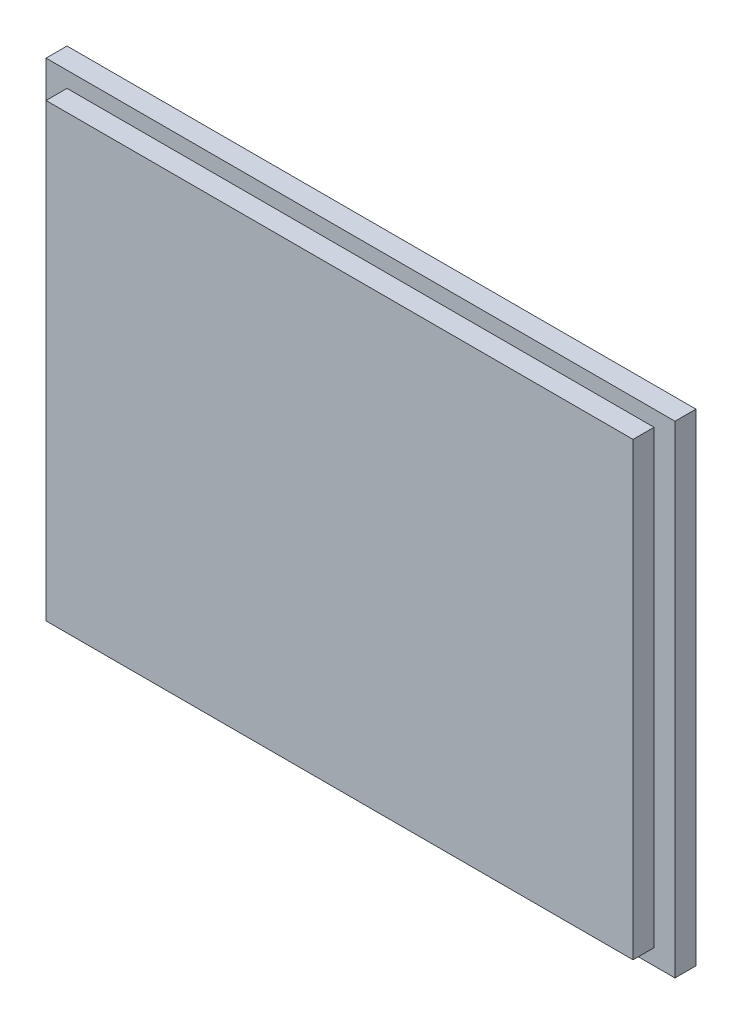
ISO-10303-21;
HEADER;
FILE_DESCRIPTION(('STEP AP214'),'2;1');
FILE_NAME('part.step','',(''),(''),'','','');
FILE_SCHEMA(('AUTOMOTIVE_DESIGN { 1 0 10303 214 1 1 1 1 }'));
ENDSEC;
DATA;
#1=APPLICATION_CONTEXT('core data for automotive mechanical design processes');
#2=APPLICATION_PROTOCOL_DEFINITION('international standard','automotive_design',2000,#1);
#3=PRODUCT_CONTEXT('',#1,'mechanical');
#4=PRODUCT('Part','Part','',(#3));
#5=PRODUCT_RELATED_PRODUCT_CATEGORY('part','',(#4));
#6=PRODUCT_DEFINITION_FORMATION('','',#4);
#7=PRODUCT_DEFINITION_CONTEXT('part definition',#1,'design');
#8=PRODUCT_DEFINITION('design','',#6,#7);
#9=PRODUCT_DEFINITION_SHAPE('','',#8);
#10=(LENGTH_UNIT() NAMED_UNIT(*) SI_UNIT(.MILLI.,.METRE.));
#11=(NAMED_UNIT(*) PLANE_ANGLE_UNIT() SI_UNIT($,.RADIAN.));
#12=(NAMED_UNIT(*) SI_UNIT($,.STERADIAN.) SOLID_ANGLE_UNIT());
#13=UNCERTAINTY_MEASURE_WITH_UNIT(LENGTH_MEASURE(1.E-05),#10,'distance_accuracy_value','');
#14=(GEOMETRIC_REPRESENTATION_CONTEXT(3) GLOBAL_UNCERTAINTY_ASSIGNED_CONTEXT((#13)) GLOBAL_UNIT_ASSIGNED_CONTEXT((#10,
#11,#12)) REPRESENTATION_CONTEXT('',''));
#15=CARTESIAN_POINT('',(0.,0.,0.));
#16=DIRECTION('',(0.,0.,1.));
#17=DIRECTION('',(1.,0.,0.));
#18=AXIS2_PLACEMENT_3D('',#15,#16,#17);
#19=CARTESIAN_POINT('',(150.,115.,10.));
#20=DIRECTION('',(-1.,0.,0.));
#21=DIRECTION('',(0.,-1.,0.));
#22=AXIS2_PLACEMENT_3D('',#19,#20,#21);
#23=PLANE('',#22);
#24=DIRECTION('',(0.,1.,0.));
#25=VECTOR('',#24,1.);
#26=CARTESIAN_POINT('',(150.,115.,0.));
#27=LINE('',#26,#25);
#28=CARTESIAN_POINT('',(150.,-115.,0.));
#29=VERTEX_POINT('',#28);
#30=CARTESIAN_POINT('',(150.,115.,0.));
#31=VERTEX_POINT('',#30);
#32=EDGE_CURVE('E117',#29,#31,#27,.T.);
#33=ORIENTED_EDGE('',*,*,#32,.T.);
#34=DIRECTION('',(0.,0.,-1.));
#35=VECTOR('',#34,1.);
#36=CARTESIAN_POINT('',(150.,115.,10.));
#37=LINE('',#36,#35);
#38=CARTESIAN_POINT('',(150.,115.,10.));
#39=VERTEX_POINT('',#38);
#40=EDGE_CURVE('E11',#39,#31,#37,.T.);
#41=ORIENTED_EDGE('',*,*,#40,.F.);
#42=DIRECTION('',(0.,1.,0.));
#43=VECTOR('',#42,1.);
#44=CARTESIAN_POINT('',(150.,115.,10.));
#45=LINE('',#44,#43);
#46=CARTESIAN_POINT('',(150.,-115.,10.));
#47=VERTEX_POINT('',#46);
#48=EDGE_CURVE('E126',#47,#39,#45,.T.);
#49=ORIENTED_EDGE('',*,*,#48,.F.);
#50=DIRECTION('',(0.,0.,-1.));
#51=VECTOR('',#50,1.);
#52=CARTESIAN_POINT('',(150.,-115.,10.));
#53=LINE('',#52,#51);
#54=EDGE_CURVE('E135',#47,#29,#53,.T.);
#55=ORIENTED_EDGE('',*,*,#54,.T.);
#56=EDGE_LOOP('',(#33,#41,#49,#55));
#57=FACE_BOUND('',#56,.T.);
#58=ADVANCED_FACE('F33',(#57),#23,.F.);
#59=CARTESIAN_POINT('',(-150.,115.,10.));
#60=DIRECTION('',(0.,-1.,0.));
#61=DIRECTION('',(0.,0.,-1.));
#62=AXIS2_PLACEMENT_3D('',#59,#60,#61);
#63=PLANE('',#62);
#64=DIRECTION('',(-1.,0.,0.));
#65=VECTOR('',#64,1.);
#66=CARTESIAN_POINT('',(-150.,115.,0.));
#67=LINE('',#66,#65);
#68=CARTESIAN_POINT('',(-150.,115.,0.));
#69=VERTEX_POINT('',#68);
#70=EDGE_CURVE('E120',#31,#69,#67,.T.);
#71=ORIENTED_EDGE('',*,*,#70,.T.);
#72=DIRECTION('',(0.,0.,-1.));
#73=VECTOR('',#72,1.);
#74=CARTESIAN_POINT('',(-150.,115.,10.));
#75=LINE('',#74,#73);
#76=CARTESIAN_POINT('',(-150.,115.,10.));
#77=VERTEX_POINT('',#76);
#78=EDGE_CURVE('E40',#77,#69,#75,.T.);
#79=ORIENTED_EDGE('',*,*,#78,.F.);
#80=DIRECTION('',(-1.,0.,0.));
#81=VECTOR('',#80,1.);
#82=CARTESIAN_POINT('',(-150.,115.,10.));
#83=LINE('',#82,#81);
#84=EDGE_CURVE('E129',#39,#77,#83,.T.);
#85=ORIENTED_EDGE('',*,*,#84,.F.);
#86=ORIENTED_EDGE('',*,*,#40,.T.);
#87=EDGE_LOOP('',(#71,#79,#85,#86));
#88=FACE_BOUND('',#87,.T.);
#89=ADVANCED_FACE('F166',(#88),#63,.F.);
#90=CARTESIAN_POINT('',(-150.,115.,10.));
#91=DIRECTION('',(1.,0.,0.));
#92=DIRECTION('',(0.,1.,0.));
#93=AXIS2_PLACEMENT_3D('',#90,#91,#92);
#94=PLANE('',#93);
#95=DIRECTION('',(0.,-1.,0.));
#96=VECTOR('',#95,1.);
#97=CARTESIAN_POINT('',(-150.,115.,0.));
#98=LINE('',#97,#96);
#99=CARTESIAN_POINT('',(-150.,-115.,0.));
#100=VERTEX_POINT('',#99);
#101=EDGE_CURVE('E138',#69,#100,#98,.T.);
#102=ORIENTED_EDGE('',*,*,#101,.T.);
#103=DIRECTION('',(0.,0.,-1.));
#104=VECTOR('',#103,1.);
#105=CARTESIAN_POINT('',(-150.,-115.,10.));
#106=LINE('',#105,#104);
#107=CARTESIAN_POINT('',(-150.,-115.,10.));
#108=VERTEX_POINT('',#107);
#109=EDGE_CURVE('E143',#108,#100,#106,.T.);
#110=ORIENTED_EDGE('',*,*,#109,.F.);
#111=DIRECTION('',(0.,-1.,0.));
#112=VECTOR('',#111,1.);
#113=CARTESIAN_POINT('',(-150.,115.,10.));
#114=LINE('',#113,#112);
#115=EDGE_CURVE('E132',#77,#108,#114,.T.);
#116=ORIENTED_EDGE('',*,*,#115,.F.);
#117=ORIENTED_EDGE('',*,*,#78,.T.);
#118=EDGE_LOOP('',(#102,#110,#116,#117));
#119=FACE_BOUND('',#118,.T.);
#120=ADVANCED_FACE('F150',(#119),#94,.F.);
#121=CARTESIAN_POINT('',(-150.,-115.,10.));
#122=DIRECTION('',(0.,1.,0.));
#123=DIRECTION('',(0.,0.,1.));
#124=AXIS2_PLACEMENT_3D('',#121,#122,#123);
#125=PLANE('',#124);
#126=DIRECTION('',(1.,0.,0.));
#127=VECTOR('',#126,1.);
#128=CARTESIAN_POINT('',(-150.,-115.,0.));
#129=LINE('',#128,#127);
#130=EDGE_CURVE('E130',#100,#29,#129,.T.);
#131=ORIENTED_EDGE('',*,*,#130,.T.);
#132=ORIENTED_EDGE('',*,*,#54,.F.);
#133=DIRECTION('',(1.,0.,0.));
#134=VECTOR('',#133,1.);
#135=CARTESIAN_POINT('',(-150.,-115.,10.));
#136=LINE('',#135,#134);
#137=EDGE_CURVE('E134',#108,#47,#136,.T.);
#138=ORIENTED_EDGE('',*,*,#137,.F.);
#139=ORIENTED_EDGE('',*,*,#109,.T.);
#140=EDGE_LOOP('',(#131,#132,#138,#139));
#141=FACE_BOUND('',#140,.T.);
#142=ADVANCED_FACE('F159',(#141),#125,.F.);
#143=CARTESIAN_POINT('',(0.,0.,10.));
#144=DIRECTION('',(0.,0.,1.));
#145=DIRECTION('',(1.,0.,0.));
#146=AXIS2_PLACEMENT_3D('',#143,#144,#145);
#147=PLANE('',#146);
#148=DIRECTION('',(0.,1.,0.));
#149=VECTOR('',#148,1.);
#150=CARTESIAN_POINT('',(140.,-107.5,10.));
#151=LINE('',#150,#149);
#152=CARTESIAN_POINT('',(140.,-107.5,10.));
#153=VERTEX_POINT('',#152);
#154=CARTESIAN_POINT('',(140.,107.5,10.));
#155=VERTEX_POINT('',#154);
#156=EDGE_CURVE('E47',#153,#155,#151,.T.);
#157=ORIENTED_EDGE('',*,*,#156,.F.);
#158=DIRECTION('',(1.,0.,0.));
#159=VECTOR('',#158,1.);
#160=CARTESIAN_POINT('',(-140.,-107.5,10.));
#161=LINE('',#160,#159);
#162=CARTESIAN_POINT('',(-140.,-107.5,10.));
#163=VERTEX_POINT('',#162);
#164=EDGE_CURVE('E51',#163,#153,#161,.T.);
#165=ORIENTED_EDGE('',*,*,#164,.F.);
#166=DIRECTION('',(0.,-1.,0.));
#167=VECTOR('',#166,1.);
#168=CARTESIAN_POINT('',(-140.,-107.5,10.));
#169=LINE('',#168,#167);
#170=CARTESIAN_POINT('',(-140.,107.5,10.));
#171=VERTEX_POINT('',#170);
#172=EDGE_CURVE('E260',#171,#163,#169,.T.);
#173=ORIENTED_EDGE('',*,*,#172,.F.);
#174=DIRECTION('',(-1.,0.,0.));
#175=VECTOR('',#174,1.);
#176=CARTESIAN_POINT('',(-140.,107.5,10.));
#177=LINE('',#176,#175);
#178=EDGE_CURVE('E266',#155,#171,#177,.T.);
#179=ORIENTED_EDGE('',*,*,#178,.F.);
#180=EDGE_LOOP('',(#157,#165,#173,#179));
#181=FACE_BOUND('',#180,.T.);
#182=ORIENTED_EDGE('',*,*,#48,.T.);
#183=ORIENTED_EDGE('',*,*,#84,.T.);
#184=ORIENTED_EDGE('',*,*,#115,.T.);
#185=ORIENTED_EDGE('',*,*,#137,.T.);
#186=EDGE_LOOP('',(#182,#183,#184,#185));
#187=FACE_BOUND('',#186,.T.);
#188=ADVANCED_FACE('F165',(#181,#187),#147,.T.);
#189=CARTESIAN_POINT('',(0.,0.,0.));
#190=DIRECTION('',(0.,0.,1.));
#191=DIRECTION('',(1.,0.,0.));
#192=AXIS2_PLACEMENT_3D('',#189,#190,#191);
#193=PLANE('',#192);
#194=ORIENTED_EDGE('',*,*,#32,.F.);
#195=ORIENTED_EDGE('',*,*,#130,.F.);
#196=ORIENTED_EDGE('',*,*,#101,.F.);
#197=ORIENTED_EDGE('',*,*,#70,.F.);
#198=EDGE_LOOP('',(#194,#195,#196,#197));
#199=FACE_BOUND('',#198,.T.);
#200=ADVANCED_FACE('F156',(#199),#193,.F.);
#201=CARTESIAN_POINT('',(140.,-107.5,20.));
#202=DIRECTION('',(-1.,0.,0.));
#203=DIRECTION('',(0.,0.,1.));
#204=AXIS2_PLACEMENT_3D('',#201,#202,#203);
#205=PLANE('',#204);
#206=ORIENTED_EDGE('',*,*,#156,.T.);
#207=DIRECTION('',(0.,0.,-1.));
#208=VECTOR('',#207,1.);
#209=CARTESIAN_POINT('',(140.,107.5,20.));
#210=LINE('',#209,#208);
#211=CARTESIAN_POINT('',(140.,107.5,20.));
#212=VERTEX_POINT('',#211);
#213=EDGE_CURVE('E100',#212,#155,#210,.T.);
#214=ORIENTED_EDGE('',*,*,#213,.F.);
#215=DIRECTION('',(0.,1.,0.));
#216=VECTOR('',#215,1.);
#217=CARTESIAN_POINT('',(140.,-107.5,20.));
#218=LINE('',#217,#216);
#219=CARTESIAN_POINT('',(140.,-107.5,20.));
#220=VERTEX_POINT('',#219);
#221=EDGE_CURVE('E106',#220,#212,#218,.T.);
#222=ORIENTED_EDGE('',*,*,#221,.F.);
#223=DIRECTION('',(0.,0.,-1.));
#224=VECTOR('',#223,1.);
#225=CARTESIAN_POINT('',(140.,-107.5,20.));
#226=LINE('',#225,#224);
#227=EDGE_CURVE('E258',#220,#153,#226,.T.);
#228=ORIENTED_EDGE('',*,*,#227,.T.);
#229=EDGE_LOOP('',(#206,#214,#222,#228));
#230=FACE_BOUND('',#229,.T.);
#231=ADVANCED_FACE('F116',(#230),#205,.F.);
#232=CARTESIAN_POINT('',(-140.,107.5,20.));
#233=DIRECTION('',(0.,-1.,0.));
#234=DIRECTION('',(0.,0.,-1.));
#235=AXIS2_PLACEMENT_3D('',#232,#233,#234);
#236=PLANE('',#235);
#237=ORIENTED_EDGE('',*,*,#178,.T.);
#238=DIRECTION('',(0.,0.,-1.));
#239=VECTOR('',#238,1.);
#240=CARTESIAN_POINT('',(-140.,107.5,20.));
#241=LINE('',#240,#239);
#242=CARTESIAN_POINT('',(-140.,107.5,20.));
#243=VERTEX_POINT('',#242);
#244=EDGE_CURVE('E102',#243,#171,#241,.T.);
#245=ORIENTED_EDGE('',*,*,#244,.F.);
#246=DIRECTION('',(-1.,0.,0.));
#247=VECTOR('',#246,1.);
#248=CARTESIAN_POINT('',(-140.,107.5,20.));
#249=LINE('',#248,#247);
#250=EDGE_CURVE('E95',#212,#243,#249,.T.);
#251=ORIENTED_EDGE('',*,*,#250,.F.);
#252=ORIENTED_EDGE('',*,*,#213,.T.);
#253=EDGE_LOOP('',(#237,#245,#251,#252));
#254=FACE_BOUND('',#253,.T.);
#255=ADVANCED_FACE('F98',(#254),#236,.F.);
#256=CARTESIAN_POINT('',(-140.,-107.5,20.));
#257=DIRECTION('',(1.,0.,0.));
#258=DIRECTION('',(0.,0.,-1.));
#259=AXIS2_PLACEMENT_3D('',#256,#257,#258);
#260=PLANE('',#259);
#261=ORIENTED_EDGE('',*,*,#172,.T.);
#262=DIRECTION('',(0.,0.,-1.));
#263=VECTOR('',#262,1.);
#264=CARTESIAN_POINT('',(-140.,-107.5,20.));
#265=LINE('',#264,#263);
#266=CARTESIAN_POINT('',(-140.,-107.5,20.));
#267=VERTEX_POINT('',#266);
#268=EDGE_CURVE('E122',#267,#163,#265,.T.);
#269=ORIENTED_EDGE('',*,*,#268,.F.);
#270=DIRECTION('',(0.,-1.,0.));
#271=VECTOR('',#270,1.);
#272=CARTESIAN_POINT('',(-140.,-107.5,20.));
#273=LINE('',#272,#271);
#274=EDGE_CURVE('E105',#243,#267,#273,.T.);
#275=ORIENTED_EDGE('',*,*,#274,.F.);
#276=ORIENTED_EDGE('',*,*,#244,.T.);
#277=EDGE_LOOP('',(#261,#269,#275,#276));
#278=FACE_BOUND('',#277,.T.);
#279=ADVANCED_FACE('F184',(#278),#260,.F.);
#280=CARTESIAN_POINT('',(-140.,-107.5,20.));
#281=DIRECTION('',(0.,1.,0.));
#282=DIRECTION('',(0.,0.,1.));
#283=AXIS2_PLACEMENT_3D('',#280,#281,#282);
#284=PLANE('',#283);
#285=ORIENTED_EDGE('',*,*,#164,.T.);
#286=ORIENTED_EDGE('',*,*,#227,.F.);
#287=DIRECTION('',(1.,0.,0.));
#288=VECTOR('',#287,1.);
#289=CARTESIAN_POINT('',(-140.,-107.5,20.));
#290=LINE('',#289,#288);
#291=EDGE_CURVE('E111',#267,#220,#290,.T.);
#292=ORIENTED_EDGE('',*,*,#291,.F.);
#293=ORIENTED_EDGE('',*,*,#268,.T.);
#294=EDGE_LOOP('',(#285,#286,#292,#293));
#295=FACE_BOUND('',#294,.T.);
#296=ADVANCED_FACE('F187',(#295),#284,.F.);
#297=CARTESIAN_POINT('',(0.,0.,20.));
#298=DIRECTION('',(0.,0.,-1.));
#299=DIRECTION('',(-1.,0.,0.));
#300=AXIS2_PLACEMENT_3D('',#297,#298,#299);
#301=PLANE('',#300);
#302=ORIENTED_EDGE('',*,*,#221,.T.);
#303=ORIENTED_EDGE('',*,*,#250,.T.);
#304=ORIENTED_EDGE('',*,*,#274,.T.);
#305=ORIENTED_EDGE('',*,*,#291,.T.);
#306=EDGE_LOOP('',(#302,#303,#304,#305));
#307=FACE_BOUND('',#306,.T.);
#308=ADVANCED_FACE('F109',(#307),#301,.F.);
#309=CLOSED_SHELL('',(#58,#89,#120,#142,#188,#200,#231,#255,#279,#296,#308));
#310=MANIFOLD_SOLID_BREP('B2',#309);
#311=ADVANCED_BREP_SHAPE_REPRESENTATION('',(#18,#310),#14);
#312=SHAPE_DEFINITION_REPRESENTATION(#9,#311);
ENDSEC;
END-ISO-10303-21;
